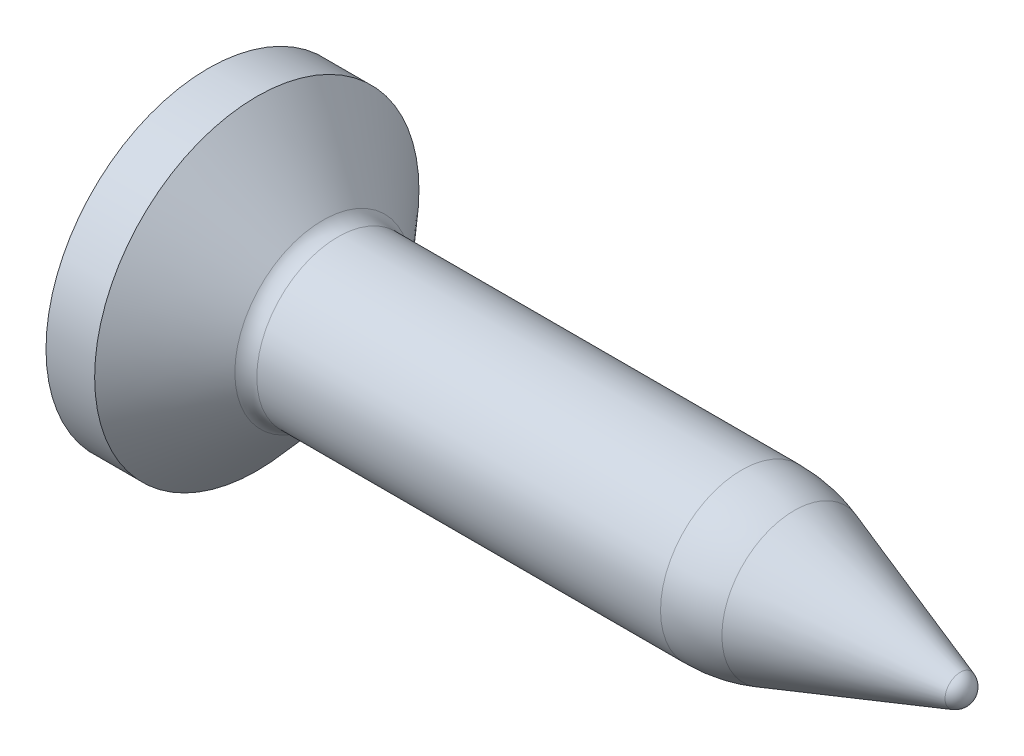
ISO-10303-21;
HEADER;
FILE_DESCRIPTION(('STEP AP214'),'2;1');
FILE_NAME('part.step','',(''),(''),'','','');
FILE_SCHEMA(('AUTOMOTIVE_DESIGN { 1 0 10303 214 1 1 1 1 }'));
ENDSEC;
DATA;
#1=APPLICATION_CONTEXT('core data for automotive mechanical design processes');
#2=APPLICATION_PROTOCOL_DEFINITION('international standard','automotive_design',2000,#1);
#3=PRODUCT_CONTEXT('',#1,'mechanical');
#4=PRODUCT('Part','Part','',(#3));
#5=PRODUCT_RELATED_PRODUCT_CATEGORY('part','',(#4));
#6=PRODUCT_DEFINITION_FORMATION('','',#4);
#7=PRODUCT_DEFINITION_CONTEXT('part definition',#1,'design');
#8=PRODUCT_DEFINITION('design','',#6,#7);
#9=PRODUCT_DEFINITION_SHAPE('','',#8);
#10=(LENGTH_UNIT() NAMED_UNIT(*) SI_UNIT(.MILLI.,.METRE.));
#11=(NAMED_UNIT(*) PLANE_ANGLE_UNIT() SI_UNIT($,.RADIAN.));
#12=(NAMED_UNIT(*) SI_UNIT($,.STERADIAN.) SOLID_ANGLE_UNIT());
#13=UNCERTAINTY_MEASURE_WITH_UNIT(LENGTH_MEASURE(1.E-05),#10,'distance_accuracy_value','');
#14=(GEOMETRIC_REPRESENTATION_CONTEXT(3) GLOBAL_UNCERTAINTY_ASSIGNED_CONTEXT((#13)) GLOBAL_UNIT_ASSIGNED_CONTEXT((#10,
#11,#12)) REPRESENTATION_CONTEXT('',''));
#15=CARTESIAN_POINT('',(0.,0.,0.));
#16=DIRECTION('',(0.,0.,1.));
#17=DIRECTION('',(1.,0.,0.));
#18=AXIS2_PLACEMENT_3D('',#15,#16,#17);
#19=CARTESIAN_POINT('',(9.21303061543301,0.,0.));
#20=DIRECTION('',(-1.,0.,0.));
#21=DIRECTION('',(0.,1.,0.));
#22=AXIS2_PLACEMENT_3D('',#19,#20,#21);
#23=SPHERICAL_SURFACE('',#22,0.2);
#24=CARTESIAN_POINT('',(9.27789548029788,0.,0.));
#25=DIRECTION('',(-1.,0.,0.));
#26=DIRECTION('',(0.,0.,1.));
#27=AXIS2_PLACEMENT_3D('',#24,#25,#26);
#28=CIRCLE('',#27,0.189189189189189);
#29=CARTESIAN_POINT('',(9.27789548029788,0.,0.189189189189189));
#30=VERTEX_POINT('',#29);
#31=EDGE_CURVE('E11',#30,#30,#28,.T.);
#32=ORIENTED_EDGE('',*,*,#31,.F.);
#33=EDGE_LOOP('',(#32));
#34=FACE_BOUND('',#33,.T.);
#35=ADVANCED_FACE('F32',(#34),#23,.T.);
#36=CARTESIAN_POINT('',(9.27789548029788,0.,0.));
#37=DIRECTION('',(-1.,0.,0.));
#38=DIRECTION('',(0.,0.,1.));
#39=AXIS2_PLACEMENT_3D('',#36,#37,#38);
#40=CONICAL_SURFACE('',#39,0.189189189189189,0.330297354829254);
#41=CARTESIAN_POINT('',(7.22834593074833,0.,0.));
#42=DIRECTION('',(-1.,0.,0.));
#43=DIRECTION('',(0.,0.,1.));
#44=AXIS2_PLACEMENT_3D('',#41,#42,#43);
#45=CIRCLE('',#44,0.891891891891892);
#46=CARTESIAN_POINT('',(7.22834593074833,0.,0.891891891891892));
#47=VERTEX_POINT('',#46);
#48=EDGE_CURVE('E39',#47,#47,#45,.T.);
#49=ORIENTED_EDGE('',*,*,#48,.F.);
#50=EDGE_LOOP('',(#49));
#51=FACE_BOUND('',#50,.T.);
#52=ORIENTED_EDGE('',*,*,#31,.T.);
#53=EDGE_LOOP('',(#52));
#54=FACE_BOUND('',#53,.T.);
#55=ADVANCED_FACE('F223',(#51,#54),#40,.T.);
#56=CARTESIAN_POINT('',(6.57969728209968,0.,0.));
#57=DIRECTION('',(-1.,0.,0.));
#58=DIRECTION('',(0.,0.,1.));
#59=AXIS2_PLACEMENT_3D('',#56,#57,#58);
#60=DEGENERATE_TOROIDAL_SURFACE('',#59,1.,2.,.F.);
#61=CARTESIAN_POINT('',(6.57969728209968,0.,0.));
#62=DIRECTION('',(-1.,0.,0.));
#63=DIRECTION('',(0.,0.,1.));
#64=AXIS2_PLACEMENT_3D('',#61,#62,#63);
#65=CIRCLE('',#64,1.);
#66=CARTESIAN_POINT('',(6.57969728209968,0.,1.));
#67=VERTEX_POINT('',#66);
#68=EDGE_CURVE('E216',#67,#67,#65,.T.);
#69=ORIENTED_EDGE('',*,*,#68,.F.);
#70=EDGE_LOOP('',(#69));
#71=FACE_BOUND('',#70,.T.);
#72=ORIENTED_EDGE('',*,*,#48,.T.);
#73=EDGE_LOOP('',(#72));
#74=FACE_BOUND('',#73,.T.);
#75=ADVANCED_FACE('F221',(#71,#74),#60,.F.);
#76=CARTESIAN_POINT('',(-3.97468528266504,0.,0.));
#77=DIRECTION('',(-1.,0.,0.));
#78=DIRECTION('',(0.,0.,1.));
#79=AXIS2_PLACEMENT_3D('',#76,#77,#78);
#80=CYLINDRICAL_SURFACE('',#79,1.);
#81=CARTESIAN_POINT('',(1.6,0.,0.));
#82=DIRECTION('',(-1.,0.,0.));
#83=DIRECTION('',(0.,0.,1.));
#84=AXIS2_PLACEMENT_3D('',#81,#82,#83);
#85=CIRCLE('',#84,1.);
#86=CARTESIAN_POINT('',(1.6,0.,1.));
#87=VERTEX_POINT('',#86);
#88=EDGE_CURVE('E213',#87,#87,#85,.T.);
#89=ORIENTED_EDGE('',*,*,#88,.F.);
#90=EDGE_LOOP('',(#89));
#91=FACE_BOUND('',#90,.T.);
#92=ORIENTED_EDGE('',*,*,#68,.T.);
#93=EDGE_LOOP('',(#92));
#94=FACE_BOUND('',#93,.T.);
#95=ADVANCED_FACE('F241',(#91,#94),#80,.T.);
#96=CARTESIAN_POINT('',(1.6,0.,0.));
#97=DIRECTION('',(-1.,0.,0.));
#98=DIRECTION('',(0.,0.,1.));
#99=AXIS2_PLACEMENT_3D('',#96,#97,#98);
#100=TOROIDAL_SURFACE('',#99,1.25,0.25);
#101=CARTESIAN_POINT('',(1.41303061543301,0.,0.));
#102=DIRECTION('',(-1.,0.,0.));
#103=DIRECTION('',(0.,0.,1.));
#104=AXIS2_PLACEMENT_3D('',#101,#102,#103);
#105=CIRCLE('',#104,1.08404082057735);
#106=CARTESIAN_POINT('',(1.41303061543301,0.,1.08404082057735));
#107=VERTEX_POINT('',#106);
#108=EDGE_CURVE('E210',#107,#107,#105,.T.);
#109=ORIENTED_EDGE('',*,*,#108,.F.);
#110=EDGE_LOOP('',(#109));
#111=FACE_BOUND('',#110,.T.);
#112=ORIENTED_EDGE('',*,*,#88,.T.);
#113=EDGE_LOOP('',(#112));
#114=FACE_BOUND('',#113,.T.);
#115=ADVANCED_FACE('F249',(#111,#114),#100,.F.);
#116=CARTESIAN_POINT('',(1.41303061543301,0.,0.));
#117=DIRECTION('',(-1.,0.,0.));
#118=DIRECTION('',(0.,0.,1.));
#119=AXIS2_PLACEMENT_3D('',#116,#117,#118);
#120=CONICAL_SURFACE('',#119,1.08404082057735,0.844859029583614);
#121=CARTESIAN_POINT('',(0.6,0.,0.));
#122=DIRECTION('',(-1.,0.,0.));
#123=DIRECTION('',(0.,0.,1.));
#124=AXIS2_PLACEMENT_3D('',#121,#122,#123);
#125=CIRCLE('',#124,2.);
#126=CARTESIAN_POINT('',(0.6,0.,2.));
#127=VERTEX_POINT('',#126);
#128=EDGE_CURVE('E207',#127,#127,#125,.T.);
#129=ORIENTED_EDGE('',*,*,#128,.F.);
#130=EDGE_LOOP('',(#129));
#131=FACE_BOUND('',#130,.T.);
#132=ORIENTED_EDGE('',*,*,#108,.T.);
#133=EDGE_LOOP('',(#132));
#134=FACE_BOUND('',#133,.T.);
#135=ADVANCED_FACE('F257',(#131,#134),#120,.T.);
#136=CARTESIAN_POINT('',(-3.97468528266504,0.,0.));
#137=DIRECTION('',(-1.,0.,0.));
#138=DIRECTION('',(0.,0.,1.));
#139=AXIS2_PLACEMENT_3D('',#136,#137,#138);
#140=CYLINDRICAL_SURFACE('',#139,2.);
#141=CARTESIAN_POINT('',(0.,0.,0.));
#142=DIRECTION('',(-1.,0.,0.));
#143=DIRECTION('',(0.,0.,1.));
#144=AXIS2_PLACEMENT_3D('',#141,#142,#143);
#145=CIRCLE('',#144,2.);
#146=CARTESIAN_POINT('',(0.,0.,2.));
#147=VERTEX_POINT('',#146);
#148=EDGE_CURVE('E187',#147,#147,#145,.T.);
#149=ORIENTED_EDGE('',*,*,#148,.F.);
#150=EDGE_LOOP('',(#149));
#151=FACE_BOUND('',#150,.T.);
#152=ORIENTED_EDGE('',*,*,#128,.T.);
#153=EDGE_LOOP('',(#152));
#154=FACE_BOUND('',#153,.T.);
#155=ADVANCED_FACE('F265',(#151,#154),#140,.T.);
#156=CARTESIAN_POINT('',(0.,0.,0.));
#157=DIRECTION('',(1.,0.,0.));
#158=DIRECTION('',(0.,0.,-1.));
#159=AXIS2_PLACEMENT_3D('',#156,#157,#158);
#160=PLANE('',#159);
#161=DIRECTION('',(0.,0.,-1.));
#162=VECTOR('',#161,1.);
#163=CARTESIAN_POINT('',(0.,1.,-0.25));
#164=LINE('',#163,#162);
#165=CARTESIAN_POINT('',(0.,1.,0.25));
#166=VERTEX_POINT('',#165);
#167=CARTESIAN_POINT('',(0.,1.,-0.25));
#168=VERTEX_POINT('',#167);
#169=EDGE_CURVE('E156',#166,#168,#164,.T.);
#170=ORIENTED_EDGE('',*,*,#169,.F.);
#171=DIRECTION('',(0.,0.984807753012208,-0.173648177666927));
#172=VECTOR('',#171,1.);
#173=CARTESIAN_POINT('',(0.,1.,0.25));
#174=LINE('',#173,#172);
#175=CARTESIAN_POINT('',(0.,0.362422173171357,0.362422173171357));
#176=VERTEX_POINT('',#175);
#177=EDGE_CURVE('E46',#176,#166,#174,.T.);
#178=ORIENTED_EDGE('',*,*,#177,.F.);
#179=DIRECTION('',(0.,0.173648177666927,-0.984807753012209));
#180=VECTOR('',#179,1.);
#181=CARTESIAN_POINT('',(0.,0.362422173171357,0.362422173171357));
#182=LINE('',#181,#180);
#183=CARTESIAN_POINT('',(0.,0.25,1.));
#184=VERTEX_POINT('',#183);
#185=EDGE_CURVE('E183',#184,#176,#182,.T.);
#186=ORIENTED_EDGE('',*,*,#185,.F.);
#187=DIRECTION('',(0.,1.,0.));
#188=VECTOR('',#187,1.);
#189=CARTESIAN_POINT('',(0.,0.25,1.));
#190=LINE('',#189,#188);
#191=CARTESIAN_POINT('',(0.,-0.25,1.));
#192=VERTEX_POINT('',#191);
#193=EDGE_CURVE('E181',#192,#184,#190,.T.);
#194=ORIENTED_EDGE('',*,*,#193,.F.);
#195=DIRECTION('',(0.,0.173648177666927,0.984807753012209));
#196=VECTOR('',#195,1.);
#197=CARTESIAN_POINT('',(0.,-0.362422173171357,0.362422173171357));
#198=LINE('',#197,#196);
#199=CARTESIAN_POINT('',(0.,-0.362422173171357,0.362422173171357));
#200=VERTEX_POINT('',#199);
#201=EDGE_CURVE('E130',#200,#192,#198,.T.);
#202=ORIENTED_EDGE('',*,*,#201,.F.);
#203=DIRECTION('',(0.,0.984807753012208,0.173648177666927));
#204=VECTOR('',#203,1.);
#205=CARTESIAN_POINT('',(0.,-1.,0.25));
#206=LINE('',#205,#204);
#207=CARTESIAN_POINT('',(0.,-1.,0.25));
#208=VERTEX_POINT('',#207);
#209=EDGE_CURVE('E177',#208,#200,#206,.T.);
#210=ORIENTED_EDGE('',*,*,#209,.F.);
#211=DIRECTION('',(0.,0.,1.));
#212=VECTOR('',#211,1.);
#213=CARTESIAN_POINT('',(0.,-1.,-0.25));
#214=LINE('',#213,#212);
#215=CARTESIAN_POINT('',(0.,-1.,-0.25));
#216=VERTEX_POINT('',#215);
#217=EDGE_CURVE('E174',#216,#208,#214,.T.);
#218=ORIENTED_EDGE('',*,*,#217,.F.);
#219=DIRECTION('',(0.,-0.984807753012208,0.173648177666927));
#220=VECTOR('',#219,1.);
#221=CARTESIAN_POINT('',(0.,-1.,-0.25));
#222=LINE('',#221,#220);
#223=CARTESIAN_POINT('',(0.,-0.362422173171357,-0.362422173171357));
#224=VERTEX_POINT('',#223);
#225=EDGE_CURVE('E171',#224,#216,#222,.T.);
#226=ORIENTED_EDGE('',*,*,#225,.F.);
#227=DIRECTION('',(0.,-0.173648177666927,0.984807753012209));
#228=VECTOR('',#227,1.);
#229=CARTESIAN_POINT('',(0.,-0.362422173171357,-0.362422173171357));
#230=LINE('',#229,#228);
#231=CARTESIAN_POINT('',(0.,-0.25,-1.));
#232=VERTEX_POINT('',#231);
#233=EDGE_CURVE('E168',#232,#224,#230,.T.);
#234=ORIENTED_EDGE('',*,*,#233,.F.);
#235=DIRECTION('',(0.,-1.,0.));
#236=VECTOR('',#235,1.);
#237=CARTESIAN_POINT('',(0.,0.25,-1.));
#238=LINE('',#237,#236);
#239=CARTESIAN_POINT('',(0.,0.25,-1.));
#240=VERTEX_POINT('',#239);
#241=EDGE_CURVE('E165',#240,#232,#238,.T.);
#242=ORIENTED_EDGE('',*,*,#241,.F.);
#243=DIRECTION('',(0.,-0.173648177666927,-0.984807753012209));
#244=VECTOR('',#243,1.);
#245=CARTESIAN_POINT('',(0.,0.362422173171357,-0.362422173171357));
#246=LINE('',#245,#244);
#247=CARTESIAN_POINT('',(0.,0.362422173171357,-0.362422173171357));
#248=VERTEX_POINT('',#247);
#249=EDGE_CURVE('E162',#248,#240,#246,.T.);
#250=ORIENTED_EDGE('',*,*,#249,.F.);
#251=DIRECTION('',(0.,-0.984807753012208,-0.173648177666927));
#252=VECTOR('',#251,1.);
#253=CARTESIAN_POINT('',(0.,1.,-0.25));
#254=LINE('',#253,#252);
#255=EDGE_CURVE('E159',#168,#248,#254,.T.);
#256=ORIENTED_EDGE('',*,*,#255,.F.);
#257=EDGE_LOOP('',(#170,#178,#186,#194,#202,#210,#218,#226,#234,#242,#250,#256));
#258=FACE_BOUND('',#257,.T.);
#259=ORIENTED_EDGE('',*,*,#148,.T.);
#260=EDGE_LOOP('',(#259));
#261=FACE_BOUND('',#260,.T.);
#262=ADVANCED_FACE('F273',(#258,#261),#160,.F.);
#263=CARTESIAN_POINT('',(0.5,1.,0.25));
#264=DIRECTION('',(0.,0.173648177666927,0.984807753012209));
#265=DIRECTION('',(0.,-0.984807753012209,0.173648177666927));
#266=AXIS2_PLACEMENT_3D('',#263,#264,#265);
#267=PLANE('',#266);
#268=ORIENTED_EDGE('',*,*,#177,.T.);
#269=DIRECTION('',(-1.,0.,0.));
#270=VECTOR('',#269,1.);
#271=CARTESIAN_POINT('',(0.5,1.,0.25));
#272=LINE('',#271,#270);
#273=CARTESIAN_POINT('',(0.5,1.,0.25));
#274=VERTEX_POINT('',#273);
#275=EDGE_CURVE('E94',#274,#166,#272,.T.);
#276=ORIENTED_EDGE('',*,*,#275,.F.);
#277=DIRECTION('',(0.,0.984807753012208,-0.173648177666927));
#278=VECTOR('',#277,1.);
#279=CARTESIAN_POINT('',(0.5,1.,0.25));
#280=LINE('',#279,#278);
#281=CARTESIAN_POINT('',(0.5,0.362422173171357,0.362422173171357));
#282=VERTEX_POINT('',#281);
#283=EDGE_CURVE('E185',#282,#274,#280,.T.);
#284=ORIENTED_EDGE('',*,*,#283,.F.);
#285=DIRECTION('',(-1.,0.,0.));
#286=VECTOR('',#285,1.);
#287=CARTESIAN_POINT('',(0.5,0.362422173171357,0.362422173171357));
#288=LINE('',#287,#286);
#289=EDGE_CURVE('E54',#282,#176,#288,.T.);
#290=ORIENTED_EDGE('',*,*,#289,.T.);
#291=EDGE_LOOP('',(#268,#276,#284,#290));
#292=FACE_BOUND('',#291,.T.);
#293=ADVANCED_FACE('F281',(#292),#267,.F.);
#294=CARTESIAN_POINT('',(0.5,0.362422173171357,0.362422173171357));
#295=DIRECTION('',(0.,0.984807753012209,0.173648177666927));
#296=DIRECTION('',(0.,-0.173648177666927,0.984807753012209));
#297=AXIS2_PLACEMENT_3D('',#294,#295,#296);
#298=PLANE('',#297);
#299=ORIENTED_EDGE('',*,*,#185,.T.);
#300=ORIENTED_EDGE('',*,*,#289,.F.);
#301=DIRECTION('',(0.,0.173648177666927,-0.984807753012209));
#302=VECTOR('',#301,1.);
#303=CARTESIAN_POINT('',(0.5,0.362422173171357,0.362422173171357));
#304=LINE('',#303,#302);
#305=CARTESIAN_POINT('',(0.5,0.25,1.));
#306=VERTEX_POINT('',#305);
#307=EDGE_CURVE('E142',#306,#282,#304,.T.);
#308=ORIENTED_EDGE('',*,*,#307,.F.);
#309=DIRECTION('',(-1.,0.,0.));
#310=VECTOR('',#309,1.);
#311=CARTESIAN_POINT('',(0.5,0.25,1.));
#312=LINE('',#311,#310);
#313=EDGE_CURVE('E134',#306,#184,#312,.T.);
#314=ORIENTED_EDGE('',*,*,#313,.T.);
#315=EDGE_LOOP('',(#299,#300,#308,#314));
#316=FACE_BOUND('',#315,.T.);
#317=ADVANCED_FACE('F289',(#316),#298,.F.);
#318=CARTESIAN_POINT('',(0.5,0.25,1.));
#319=DIRECTION('',(0.,0.,1.));
#320=DIRECTION('',(1.,0.,0.));
#321=AXIS2_PLACEMENT_3D('',#318,#319,#320);
#322=PLANE('',#321);
#323=ORIENTED_EDGE('',*,*,#193,.T.);
#324=ORIENTED_EDGE('',*,*,#313,.F.);
#325=DIRECTION('',(0.,1.,0.));
#326=VECTOR('',#325,1.);
#327=CARTESIAN_POINT('',(0.5,0.25,1.));
#328=LINE('',#327,#326);
#329=CARTESIAN_POINT('',(0.5,-0.25,1.));
#330=VERTEX_POINT('',#329);
#331=EDGE_CURVE('E138',#330,#306,#328,.T.);
#332=ORIENTED_EDGE('',*,*,#331,.F.);
#333=DIRECTION('',(-1.,0.,0.));
#334=VECTOR('',#333,1.);
#335=CARTESIAN_POINT('',(0.5,-0.25,1.));
#336=LINE('',#335,#334);
#337=EDGE_CURVE('E123',#330,#192,#336,.T.);
#338=ORIENTED_EDGE('',*,*,#337,.T.);
#339=EDGE_LOOP('',(#323,#324,#332,#338));
#340=FACE_BOUND('',#339,.T.);
#341=ADVANCED_FACE('F139',(#340),#322,.F.);
#342=CARTESIAN_POINT('',(0.5,-0.362422173171357,0.362422173171357));
#343=DIRECTION('',(0.,-0.984807753012209,0.173648177666927));
#344=DIRECTION('',(0.,-0.173648177666927,-0.984807753012209));
#345=AXIS2_PLACEMENT_3D('',#342,#343,#344);
#346=PLANE('',#345);
#347=ORIENTED_EDGE('',*,*,#201,.T.);
#348=ORIENTED_EDGE('',*,*,#337,.F.);
#349=DIRECTION('',(0.,0.173648177666927,0.984807753012209));
#350=VECTOR('',#349,1.);
#351=CARTESIAN_POINT('',(0.5,-0.362422173171357,0.362422173171357));
#352=LINE('',#351,#350);
#353=CARTESIAN_POINT('',(0.5,-0.362422173171357,0.362422173171357));
#354=VERTEX_POINT('',#353);
#355=EDGE_CURVE('E127',#354,#330,#352,.T.);
#356=ORIENTED_EDGE('',*,*,#355,.F.);
#357=DIRECTION('',(-1.,0.,0.));
#358=VECTOR('',#357,1.);
#359=CARTESIAN_POINT('',(0.5,-0.362422173171357,0.362422173171357));
#360=LINE('',#359,#358);
#361=EDGE_CURVE('E135',#354,#200,#360,.T.);
#362=ORIENTED_EDGE('',*,*,#361,.T.);
#363=EDGE_LOOP('',(#347,#348,#356,#362));
#364=FACE_BOUND('',#363,.T.);
#365=ADVANCED_FACE('F125',(#364),#346,.F.);
#366=CARTESIAN_POINT('',(0.5,-1.,0.25));
#367=DIRECTION('',(0.,-0.173648177666927,0.984807753012209));
#368=DIRECTION('',(0.,-0.984807753012209,-0.173648177666927));
#369=AXIS2_PLACEMENT_3D('',#366,#367,#368);
#370=PLANE('',#369);
#371=ORIENTED_EDGE('',*,*,#209,.T.);
#372=ORIENTED_EDGE('',*,*,#361,.F.);
#373=DIRECTION('',(0.,0.984807753012208,0.173648177666927));
#374=VECTOR('',#373,1.);
#375=CARTESIAN_POINT('',(0.5,-1.,0.25));
#376=LINE('',#375,#374);
#377=CARTESIAN_POINT('',(0.5,-1.,0.25));
#378=VERTEX_POINT('',#377);
#379=EDGE_CURVE('E148',#378,#354,#376,.T.);
#380=ORIENTED_EDGE('',*,*,#379,.F.);
#381=DIRECTION('',(-1.,0.,0.));
#382=VECTOR('',#381,1.);
#383=CARTESIAN_POINT('',(0.5,-1.,0.25));
#384=LINE('',#383,#382);
#385=EDGE_CURVE('E190',#378,#208,#384,.T.);
#386=ORIENTED_EDGE('',*,*,#385,.T.);
#387=EDGE_LOOP('',(#371,#372,#380,#386));
#388=FACE_BOUND('',#387,.T.);
#389=ADVANCED_FACE('F308',(#388),#370,.F.);
#390=CARTESIAN_POINT('',(0.5,-1.,-0.25));
#391=DIRECTION('',(0.,-1.,0.));
#392=DIRECTION('',(0.,0.,-1.));
#393=AXIS2_PLACEMENT_3D('',#390,#391,#392);
#394=PLANE('',#393);
#395=ORIENTED_EDGE('',*,*,#217,.T.);
#396=ORIENTED_EDGE('',*,*,#385,.F.);
#397=DIRECTION('',(0.,0.,1.));
#398=VECTOR('',#397,1.);
#399=CARTESIAN_POINT('',(0.5,-1.,-0.25));
#400=LINE('',#399,#398);
#401=CARTESIAN_POINT('',(0.5,-1.,-0.25));
#402=VERTEX_POINT('',#401);
#403=EDGE_CURVE('E150',#402,#378,#400,.T.);
#404=ORIENTED_EDGE('',*,*,#403,.F.);
#405=DIRECTION('',(-1.,0.,0.));
#406=VECTOR('',#405,1.);
#407=CARTESIAN_POINT('',(0.5,-1.,-0.25));
#408=LINE('',#407,#406);
#409=EDGE_CURVE('E192',#402,#216,#408,.T.);
#410=ORIENTED_EDGE('',*,*,#409,.T.);
#411=EDGE_LOOP('',(#395,#396,#404,#410));
#412=FACE_BOUND('',#411,.T.);
#413=ADVANCED_FACE('F315',(#412),#394,.F.);
#414=CARTESIAN_POINT('',(0.5,-1.,-0.25));
#415=DIRECTION('',(0.,-0.173648177666927,-0.984807753012209));
#416=DIRECTION('',(0.,0.984807753012209,-0.173648177666927));
#417=AXIS2_PLACEMENT_3D('',#414,#415,#416);
#418=PLANE('',#417);
#419=ORIENTED_EDGE('',*,*,#225,.T.);
#420=ORIENTED_EDGE('',*,*,#409,.F.);
#421=DIRECTION('',(0.,-0.984807753012208,0.173648177666927));
#422=VECTOR('',#421,1.);
#423=CARTESIAN_POINT('',(0.5,-1.,-0.25));
#424=LINE('',#423,#422);
#425=CARTESIAN_POINT('',(0.5,-0.362422173171357,-0.362422173171357));
#426=VERTEX_POINT('',#425);
#427=EDGE_CURVE('E446',#426,#402,#424,.T.);
#428=ORIENTED_EDGE('',*,*,#427,.F.);
#429=DIRECTION('',(-1.,0.,0.));
#430=VECTOR('',#429,1.);
#431=CARTESIAN_POINT('',(0.5,-0.362422173171357,-0.362422173171357));
#432=LINE('',#431,#430);
#433=EDGE_CURVE('E194',#426,#224,#432,.T.);
#434=ORIENTED_EDGE('',*,*,#433,.T.);
#435=EDGE_LOOP('',(#419,#420,#428,#434));
#436=FACE_BOUND('',#435,.T.);
#437=ADVANCED_FACE('F323',(#436),#418,.F.);
#438=CARTESIAN_POINT('',(0.5,-0.362422173171357,-0.362422173171357));
#439=DIRECTION('',(0.,-0.984807753012209,-0.173648177666927));
#440=DIRECTION('',(0.,0.173648177666927,-0.984807753012209));
#441=AXIS2_PLACEMENT_3D('',#438,#439,#440);
#442=PLANE('',#441);
#443=ORIENTED_EDGE('',*,*,#233,.T.);
#444=ORIENTED_EDGE('',*,*,#433,.F.);
#445=DIRECTION('',(0.,-0.173648177666927,0.984807753012209));
#446=VECTOR('',#445,1.);
#447=CARTESIAN_POINT('',(0.5,-0.362422173171357,-0.362422173171357));
#448=LINE('',#447,#446);
#449=CARTESIAN_POINT('',(0.5,-0.25,-1.));
#450=VERTEX_POINT('',#449);
#451=EDGE_CURVE('E443',#450,#426,#448,.T.);
#452=ORIENTED_EDGE('',*,*,#451,.F.);
#453=DIRECTION('',(-1.,0.,0.));
#454=VECTOR('',#453,1.);
#455=CARTESIAN_POINT('',(0.5,-0.25,-1.));
#456=LINE('',#455,#454);
#457=EDGE_CURVE('E196',#450,#232,#456,.T.);
#458=ORIENTED_EDGE('',*,*,#457,.T.);
#459=EDGE_LOOP('',(#443,#444,#452,#458));
#460=FACE_BOUND('',#459,.T.);
#461=ADVANCED_FACE('F331',(#460),#442,.F.);
#462=CARTESIAN_POINT('',(0.5,0.25,-1.));
#463=DIRECTION('',(0.,0.,-1.));
#464=DIRECTION('',(-1.,0.,0.));
#465=AXIS2_PLACEMENT_3D('',#462,#463,#464);
#466=PLANE('',#465);
#467=ORIENTED_EDGE('',*,*,#241,.T.);
#468=ORIENTED_EDGE('',*,*,#457,.F.);
#469=DIRECTION('',(0.,-1.,0.));
#470=VECTOR('',#469,1.);
#471=CARTESIAN_POINT('',(0.5,0.25,-1.));
#472=LINE('',#471,#470);
#473=CARTESIAN_POINT('',(0.5,0.25,-1.));
#474=VERTEX_POINT('',#473);
#475=EDGE_CURVE('E440',#474,#450,#472,.T.);
#476=ORIENTED_EDGE('',*,*,#475,.F.);
#477=DIRECTION('',(-1.,0.,0.));
#478=VECTOR('',#477,1.);
#479=CARTESIAN_POINT('',(0.5,0.25,-1.));
#480=LINE('',#479,#478);
#481=EDGE_CURVE('E198',#474,#240,#480,.T.);
#482=ORIENTED_EDGE('',*,*,#481,.T.);
#483=EDGE_LOOP('',(#467,#468,#476,#482));
#484=FACE_BOUND('',#483,.T.);
#485=ADVANCED_FACE('F339',(#484),#466,.F.);
#486=CARTESIAN_POINT('',(0.5,0.362422173171357,-0.362422173171357));
#487=DIRECTION('',(0.,0.984807753012209,-0.173648177666927));
#488=DIRECTION('',(0.,0.173648177666927,0.984807753012209));
#489=AXIS2_PLACEMENT_3D('',#486,#487,#488);
#490=PLANE('',#489);
#491=ORIENTED_EDGE('',*,*,#249,.T.);
#492=ORIENTED_EDGE('',*,*,#481,.F.);
#493=DIRECTION('',(0.,-0.173648177666927,-0.984807753012209));
#494=VECTOR('',#493,1.);
#495=CARTESIAN_POINT('',(0.5,0.362422173171357,-0.362422173171357));
#496=LINE('',#495,#494);
#497=CARTESIAN_POINT('',(0.5,0.362422173171357,-0.362422173171357));
#498=VERTEX_POINT('',#497);
#499=EDGE_CURVE('E433',#498,#474,#496,.T.);
#500=ORIENTED_EDGE('',*,*,#499,.F.);
#501=DIRECTION('',(-1.,0.,0.));
#502=VECTOR('',#501,1.);
#503=CARTESIAN_POINT('',(0.5,0.362422173171357,-0.362422173171357));
#504=LINE('',#503,#502);
#505=EDGE_CURVE('E200',#498,#248,#504,.T.);
#506=ORIENTED_EDGE('',*,*,#505,.T.);
#507=EDGE_LOOP('',(#491,#492,#500,#506));
#508=FACE_BOUND('',#507,.T.);
#509=ADVANCED_FACE('F347',(#508),#490,.F.);
#510=CARTESIAN_POINT('',(0.5,1.,-0.25));
#511=DIRECTION('',(0.,0.173648177666927,-0.984807753012209));
#512=DIRECTION('',(0.,0.984807753012209,0.173648177666927));
#513=AXIS2_PLACEMENT_3D('',#510,#511,#512);
#514=PLANE('',#513);
#515=ORIENTED_EDGE('',*,*,#255,.T.);
#516=ORIENTED_EDGE('',*,*,#505,.F.);
#517=DIRECTION('',(0.,-0.984807753012208,-0.173648177666927));
#518=VECTOR('',#517,1.);
#519=CARTESIAN_POINT('',(0.5,1.,-0.25));
#520=LINE('',#519,#518);
#521=CARTESIAN_POINT('',(0.5,1.,-0.25));
#522=VERTEX_POINT('',#521);
#523=EDGE_CURVE('E430',#522,#498,#520,.T.);
#524=ORIENTED_EDGE('',*,*,#523,.F.);
#525=DIRECTION('',(-1.,0.,0.));
#526=VECTOR('',#525,1.);
#527=CARTESIAN_POINT('',(0.5,1.,-0.25));
#528=LINE('',#527,#526);
#529=EDGE_CURVE('E202',#522,#168,#528,.T.);
#530=ORIENTED_EDGE('',*,*,#529,.T.);
#531=EDGE_LOOP('',(#515,#516,#524,#530));
#532=FACE_BOUND('',#531,.T.);
#533=ADVANCED_FACE('F355',(#532),#514,.F.);
#534=CARTESIAN_POINT('',(0.5,1.,-0.25));
#535=DIRECTION('',(0.,1.,0.));
#536=DIRECTION('',(0.,0.,1.));
#537=AXIS2_PLACEMENT_3D('',#534,#535,#536);
#538=PLANE('',#537);
#539=ORIENTED_EDGE('',*,*,#169,.T.);
#540=ORIENTED_EDGE('',*,*,#529,.F.);
#541=DIRECTION('',(0.,0.,-1.));
#542=VECTOR('',#541,1.);
#543=CARTESIAN_POINT('',(0.5,1.,-0.25));
#544=LINE('',#543,#542);
#545=EDGE_CURVE('E434',#274,#522,#544,.T.);
#546=ORIENTED_EDGE('',*,*,#545,.F.);
#547=ORIENTED_EDGE('',*,*,#275,.T.);
#548=EDGE_LOOP('',(#539,#540,#546,#547));
#549=FACE_BOUND('',#548,.T.);
#550=ADVANCED_FACE('F363',(#549),#538,.F.);
#551=CARTESIAN_POINT('',(0.5,0.,0.));
#552=DIRECTION('',(-1.,0.,0.));
#553=DIRECTION('',(0.,0.,1.));
#554=AXIS2_PLACEMENT_3D('',#551,#552,#553);
#555=PLANE('',#554);
#556=ORIENTED_EDGE('',*,*,#283,.T.);
#557=ORIENTED_EDGE('',*,*,#545,.T.);
#558=ORIENTED_EDGE('',*,*,#523,.T.);
#559=ORIENTED_EDGE('',*,*,#499,.T.);
#560=ORIENTED_EDGE('',*,*,#475,.T.);
#561=ORIENTED_EDGE('',*,*,#451,.T.);
#562=ORIENTED_EDGE('',*,*,#427,.T.);
#563=ORIENTED_EDGE('',*,*,#403,.T.);
#564=ORIENTED_EDGE('',*,*,#379,.T.);
#565=ORIENTED_EDGE('',*,*,#355,.T.);
#566=ORIENTED_EDGE('',*,*,#331,.T.);
#567=ORIENTED_EDGE('',*,*,#307,.T.);
#568=EDGE_LOOP('',(#556,#557,#558,#559,#560,#561,#562,#563,#564,#565,#566,#567));
#569=FACE_BOUND('',#568,.T.);
#570=ADVANCED_FACE('F145',(#569),#555,.T.);
#571=CLOSED_SHELL('',(#35,#55,#75,#95,#115,#135,#155,#262,#293,#317,#341,#365,#389,#413,#437,
#461,#485,#509,#533,#550,#570));
#572=MANIFOLD_SOLID_BREP('B2',#571);
#573=ADVANCED_BREP_SHAPE_REPRESENTATION('',(#18,#572),#14);
#574=SHAPE_DEFINITION_REPRESENTATION(#9,#573);
ENDSEC;
END-ISO-10303-21;
